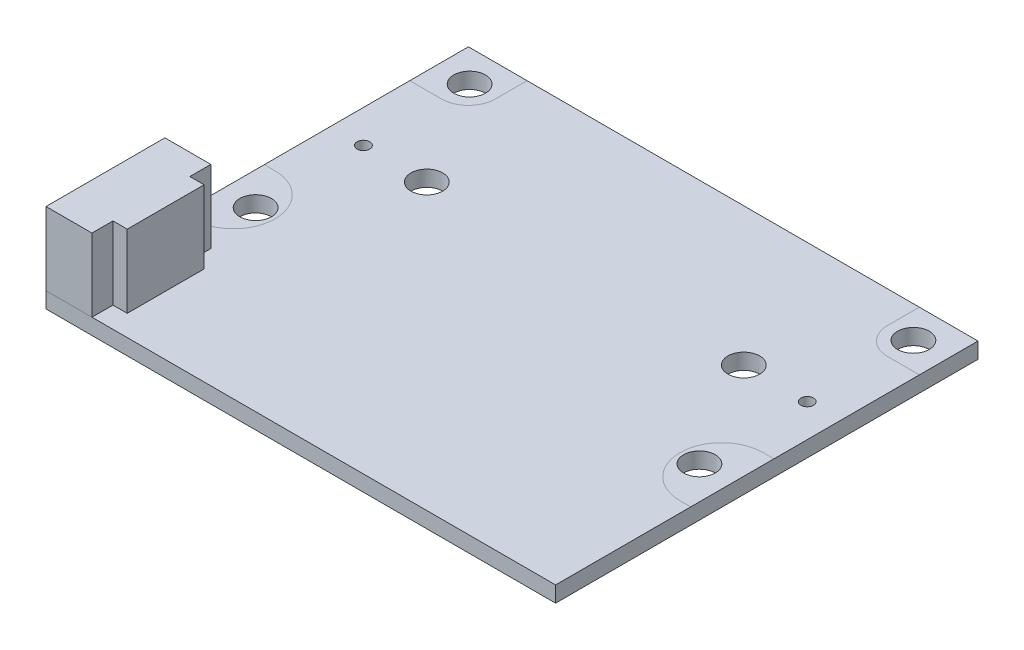
ISO-10303-21;
HEADER;
FILE_DESCRIPTION(('STEP AP214'),'2;1');
FILE_NAME('part.step','',(''),(''),'','','');
FILE_SCHEMA(('AUTOMOTIVE_DESIGN { 1 0 10303 214 1 1 1 1 }'));
ENDSEC;
DATA;
#1=APPLICATION_CONTEXT('core data for automotive mechanical design processes');
#2=APPLICATION_PROTOCOL_DEFINITION('international standard','automotive_design',2000,#1);
#3=PRODUCT_CONTEXT('',#1,'mechanical');
#4=PRODUCT('Part','Part','',(#3));
#5=PRODUCT_RELATED_PRODUCT_CATEGORY('part','',(#4));
#6=PRODUCT_DEFINITION_FORMATION('','',#4);
#7=PRODUCT_DEFINITION_CONTEXT('part definition',#1,'design');
#8=PRODUCT_DEFINITION('design','',#6,#7);
#9=PRODUCT_DEFINITION_SHAPE('','',#8);
#10=(LENGTH_UNIT() NAMED_UNIT(*) SI_UNIT(.MILLI.,.METRE.));
#11=(NAMED_UNIT(*) PLANE_ANGLE_UNIT() SI_UNIT($,.RADIAN.));
#12=(NAMED_UNIT(*) SI_UNIT($,.STERADIAN.) SOLID_ANGLE_UNIT());
#13=UNCERTAINTY_MEASURE_WITH_UNIT(LENGTH_MEASURE(1.E-05),#10,'distance_accuracy_value','');
#14=(GEOMETRIC_REPRESENTATION_CONTEXT(3) GLOBAL_UNCERTAINTY_ASSIGNED_CONTEXT((#13)) GLOBAL_UNIT_ASSIGNED_CONTEXT((#10,
#11,#12)) REPRESENTATION_CONTEXT('',''));
#15=CARTESIAN_POINT('',(0.,0.,0.));
#16=DIRECTION('',(0.,0.,1.));
#17=DIRECTION('',(1.,0.,0.));
#18=AXIS2_PLACEMENT_3D('',#15,#16,#17);
#19=CARTESIAN_POINT('',(-16.075,5.6,17.95));
#20=DIRECTION('',(1.,0.,0.));
#21=DIRECTION('',(0.,0.,-1.));
#22=AXIS2_PLACEMENT_3D('',#19,#20,#21);
#23=PLANE('',#22);
#24=DIRECTION('',(0.,0.,1.));
#25=VECTOR('',#24,1.);
#26=CARTESIAN_POINT('',(-16.075,1.,17.95));
#27=LINE('',#26,#25);
#28=CARTESIAN_POINT('',(-16.075,1.,10.45));
#29=VERTEX_POINT('',#28);
#30=CARTESIAN_POINT('',(-16.075,1.,17.95));
#31=VERTEX_POINT('',#30);
#32=EDGE_CURVE('E150',#29,#31,#27,.T.);
#33=ORIENTED_EDGE('',*,*,#32,.T.);
#34=DIRECTION('',(0.,-1.,0.));
#35=VECTOR('',#34,1.);
#36=CARTESIAN_POINT('',(-16.075,5.6,17.95));
#37=LINE('',#36,#35);
#38=CARTESIAN_POINT('',(-16.075,5.6,17.95));
#39=VERTEX_POINT('',#38);
#40=EDGE_CURVE('E12',#39,#31,#37,.T.);
#41=ORIENTED_EDGE('',*,*,#40,.F.);
#42=DIRECTION('',(0.,0.,1.));
#43=VECTOR('',#42,1.);
#44=CARTESIAN_POINT('',(-16.075,5.6,17.95));
#45=LINE('',#44,#43);
#46=CARTESIAN_POINT('',(-16.075,5.6,10.45));
#47=VERTEX_POINT('',#46);
#48=EDGE_CURVE('E164',#47,#39,#45,.T.);
#49=ORIENTED_EDGE('',*,*,#48,.F.);
#50=DIRECTION('',(0.,-1.,0.));
#51=VECTOR('',#50,1.);
#52=CARTESIAN_POINT('',(-16.075,5.6,10.45));
#53=LINE('',#52,#51);
#54=EDGE_CURVE('E146',#47,#29,#53,.T.);
#55=ORIENTED_EDGE('',*,*,#54,.T.);
#56=EDGE_LOOP('',(#33,#41,#49,#55));
#57=FACE_BOUND('',#56,.T.);
#58=ADVANCED_FACE('F54',(#57),#23,.F.);
#59=CARTESIAN_POINT('',(-16.075,5.6,17.95));
#60=DIRECTION('',(0.,0.,-1.));
#61=DIRECTION('',(-1.,0.,0.));
#62=AXIS2_PLACEMENT_3D('',#59,#60,#61);
#63=PLANE('',#62);
#64=DIRECTION('',(1.,0.,0.));
#65=VECTOR('',#64,1.);
#66=CARTESIAN_POINT('',(-16.075,1.,17.95));
#67=LINE('',#66,#65);
#68=CARTESIAN_POINT('',(-13.175,1.,17.95));
#69=VERTEX_POINT('',#68);
#70=EDGE_CURVE('E153',#31,#69,#67,.T.);
#71=ORIENTED_EDGE('',*,*,#70,.T.);
#72=DIRECTION('',(0.,-1.,0.));
#73=VECTOR('',#72,1.);
#74=CARTESIAN_POINT('',(-13.175,5.6,17.95));
#75=LINE('',#74,#73);
#76=CARTESIAN_POINT('',(-13.175,5.6,17.95));
#77=VERTEX_POINT('',#76);
#78=EDGE_CURVE('E62',#77,#69,#75,.T.);
#79=ORIENTED_EDGE('',*,*,#78,.F.);
#80=DIRECTION('',(1.,0.,0.));
#81=VECTOR('',#80,1.);
#82=CARTESIAN_POINT('',(-16.075,5.6,17.95));
#83=LINE('',#82,#81);
#84=EDGE_CURVE('E113',#39,#77,#83,.T.);
#85=ORIENTED_EDGE('',*,*,#84,.F.);
#86=ORIENTED_EDGE('',*,*,#40,.T.);
#87=EDGE_LOOP('',(#71,#79,#85,#86));
#88=FACE_BOUND('',#87,.T.);
#89=ADVANCED_FACE('F199',(#88),#63,.F.);
#90=CARTESIAN_POINT('',(-13.175,5.6,17.95));
#91=DIRECTION('',(-1.,0.,0.));
#92=DIRECTION('',(0.,0.,1.));
#93=AXIS2_PLACEMENT_3D('',#90,#91,#92);
#94=PLANE('',#93);
#95=DIRECTION('',(0.,0.,-1.));
#96=VECTOR('',#95,1.);
#97=CARTESIAN_POINT('',(-13.175,1.,17.95));
#98=LINE('',#97,#96);
#99=CARTESIAN_POINT('',(-13.175,1.,16.625));
#100=VERTEX_POINT('',#99);
#101=EDGE_CURVE('E155',#69,#100,#98,.T.);
#102=ORIENTED_EDGE('',*,*,#101,.T.);
#103=DIRECTION('',(0.,-1.,0.));
#104=VECTOR('',#103,1.);
#105=CARTESIAN_POINT('',(-13.175,5.6,16.625));
#106=LINE('',#105,#104);
#107=CARTESIAN_POINT('',(-13.175,5.6,16.625));
#108=VERTEX_POINT('',#107);
#109=EDGE_CURVE('E171',#108,#100,#106,.T.);
#110=ORIENTED_EDGE('',*,*,#109,.F.);
#111=DIRECTION('',(0.,0.,-1.));
#112=VECTOR('',#111,1.);
#113=CARTESIAN_POINT('',(-13.175,5.6,17.95));
#114=LINE('',#113,#112);
#115=EDGE_CURVE('E179',#77,#108,#114,.T.);
#116=ORIENTED_EDGE('',*,*,#115,.F.);
#117=ORIENTED_EDGE('',*,*,#78,.T.);
#118=EDGE_LOOP('',(#102,#110,#116,#117));
#119=FACE_BOUND('',#118,.T.);
#120=ADVANCED_FACE('F177',(#119),#94,.F.);
#121=CARTESIAN_POINT('',(-13.175,5.6,16.625));
#122=DIRECTION('',(0.,0.,-1.));
#123=DIRECTION('',(-1.,0.,0.));
#124=AXIS2_PLACEMENT_3D('',#121,#122,#123);
#125=PLANE('',#124);
#126=DIRECTION('',(1.,0.,0.));
#127=VECTOR('',#126,1.);
#128=CARTESIAN_POINT('',(-13.175,1.,16.625));
#129=LINE('',#128,#127);
#130=CARTESIAN_POINT('',(-12.275,1.,16.625));
#131=VERTEX_POINT('',#130);
#132=EDGE_CURVE('E157',#100,#131,#129,.T.);
#133=ORIENTED_EDGE('',*,*,#132,.T.);
#134=DIRECTION('',(0.,-1.,0.));
#135=VECTOR('',#134,1.);
#136=CARTESIAN_POINT('',(-12.275,5.6,16.625));
#137=LINE('',#136,#135);
#138=CARTESIAN_POINT('',(-12.275,5.6,16.625));
#139=VERTEX_POINT('',#138);
#140=EDGE_CURVE('E168',#139,#131,#137,.T.);
#141=ORIENTED_EDGE('',*,*,#140,.F.);
#142=DIRECTION('',(1.,0.,0.));
#143=VECTOR('',#142,1.);
#144=CARTESIAN_POINT('',(-13.175,5.6,16.625));
#145=LINE('',#144,#143);
#146=EDGE_CURVE('E191',#108,#139,#145,.T.);
#147=ORIENTED_EDGE('',*,*,#146,.F.);
#148=ORIENTED_EDGE('',*,*,#109,.T.);
#149=EDGE_LOOP('',(#133,#141,#147,#148));
#150=FACE_BOUND('',#149,.T.);
#151=ADVANCED_FACE('F187',(#150),#125,.F.);
#152=CARTESIAN_POINT('',(-12.275,5.6,16.625));
#153=DIRECTION('',(-1.,0.,0.));
#154=DIRECTION('',(0.,0.,1.));
#155=AXIS2_PLACEMENT_3D('',#152,#153,#154);
#156=PLANE('',#155);
#157=DIRECTION('',(0.,0.,-1.));
#158=VECTOR('',#157,1.);
#159=CARTESIAN_POINT('',(-12.275,1.,16.625));
#160=LINE('',#159,#158);
#161=CARTESIAN_POINT('',(-12.275,1.,11.775));
#162=VERTEX_POINT('',#161);
#163=EDGE_CURVE('E159',#131,#162,#160,.T.);
#164=ORIENTED_EDGE('',*,*,#163,.T.);
#165=DIRECTION('',(0.,-1.,0.));
#166=VECTOR('',#165,1.);
#167=CARTESIAN_POINT('',(-12.275,5.6,11.775));
#168=LINE('',#167,#166);
#169=CARTESIAN_POINT('',(-12.275,5.6,11.775));
#170=VERTEX_POINT('',#169);
#171=EDGE_CURVE('E141',#170,#162,#168,.T.);
#172=ORIENTED_EDGE('',*,*,#171,.F.);
#173=DIRECTION('',(0.,0.,-1.));
#174=VECTOR('',#173,1.);
#175=CARTESIAN_POINT('',(-12.275,5.6,16.625));
#176=LINE('',#175,#174);
#177=EDGE_CURVE('E132',#139,#170,#176,.T.);
#178=ORIENTED_EDGE('',*,*,#177,.F.);
#179=ORIENTED_EDGE('',*,*,#140,.T.);
#180=EDGE_LOOP('',(#164,#172,#178,#179));
#181=FACE_BOUND('',#180,.T.);
#182=ADVANCED_FACE('F190',(#181),#156,.F.);
#183=CARTESIAN_POINT('',(-13.175,5.6,11.775));
#184=DIRECTION('',(0.,0.,1.));
#185=DIRECTION('',(1.,0.,0.));
#186=AXIS2_PLACEMENT_3D('',#183,#184,#185);
#187=PLANE('',#186);
#188=DIRECTION('',(-1.,0.,0.));
#189=VECTOR('',#188,1.);
#190=CARTESIAN_POINT('',(-13.175,1.,11.775));
#191=LINE('',#190,#189);
#192=CARTESIAN_POINT('',(-13.175,1.,11.775));
#193=VERTEX_POINT('',#192);
#194=EDGE_CURVE('E140',#162,#193,#191,.T.);
#195=ORIENTED_EDGE('',*,*,#194,.T.);
#196=DIRECTION('',(0.,-1.,0.));
#197=VECTOR('',#196,1.);
#198=CARTESIAN_POINT('',(-13.175,5.6,11.775));
#199=LINE('',#198,#197);
#200=CARTESIAN_POINT('',(-13.175,5.6,11.775));
#201=VERTEX_POINT('',#200);
#202=EDGE_CURVE('E137',#201,#193,#199,.T.);
#203=ORIENTED_EDGE('',*,*,#202,.F.);
#204=DIRECTION('',(-1.,0.,0.));
#205=VECTOR('',#204,1.);
#206=CARTESIAN_POINT('',(-13.175,5.6,11.775));
#207=LINE('',#206,#205);
#208=EDGE_CURVE('E126',#170,#201,#207,.T.);
#209=ORIENTED_EDGE('',*,*,#208,.F.);
#210=ORIENTED_EDGE('',*,*,#171,.T.);
#211=EDGE_LOOP('',(#195,#203,#209,#210));
#212=FACE_BOUND('',#211,.T.);
#213=ADVANCED_FACE('F138',(#212),#187,.F.);
#214=CARTESIAN_POINT('',(-13.175,5.6,11.775));
#215=DIRECTION('',(-1.,0.,0.));
#216=DIRECTION('',(0.,0.,1.));
#217=AXIS2_PLACEMENT_3D('',#214,#215,#216);
#218=PLANE('',#217);
#219=DIRECTION('',(0.,0.,-1.));
#220=VECTOR('',#219,1.);
#221=CARTESIAN_POINT('',(-13.175,1.,11.775));
#222=LINE('',#221,#220);
#223=CARTESIAN_POINT('',(-13.175,1.,10.45));
#224=VERTEX_POINT('',#223);
#225=EDGE_CURVE('E99',#193,#224,#222,.T.);
#226=ORIENTED_EDGE('',*,*,#225,.T.);
#227=DIRECTION('',(0.,-1.,0.));
#228=VECTOR('',#227,1.);
#229=CARTESIAN_POINT('',(-13.175,5.6,10.45));
#230=LINE('',#229,#228);
#231=CARTESIAN_POINT('',(-13.175,5.6,10.45));
#232=VERTEX_POINT('',#231);
#233=EDGE_CURVE('E142',#232,#224,#230,.T.);
#234=ORIENTED_EDGE('',*,*,#233,.F.);
#235=DIRECTION('',(0.,0.,-1.));
#236=VECTOR('',#235,1.);
#237=CARTESIAN_POINT('',(-13.175,5.6,11.775));
#238=LINE('',#237,#236);
#239=EDGE_CURVE('E130',#201,#232,#238,.T.);
#240=ORIENTED_EDGE('',*,*,#239,.F.);
#241=ORIENTED_EDGE('',*,*,#202,.T.);
#242=EDGE_LOOP('',(#226,#234,#240,#241));
#243=FACE_BOUND('',#242,.T.);
#244=ADVANCED_FACE('F144',(#243),#218,.F.);
#245=CARTESIAN_POINT('',(-16.075,5.6,10.45));
#246=DIRECTION('',(0.,0.,1.));
#247=DIRECTION('',(1.,0.,0.));
#248=AXIS2_PLACEMENT_3D('',#245,#246,#247);
#249=PLANE('',#248);
#250=DIRECTION('',(-1.,0.,0.));
#251=VECTOR('',#250,1.);
#252=CARTESIAN_POINT('',(-16.075,1.,10.45));
#253=LINE('',#252,#251);
#254=EDGE_CURVE('E105',#224,#29,#253,.T.);
#255=ORIENTED_EDGE('',*,*,#254,.T.);
#256=ORIENTED_EDGE('',*,*,#54,.F.);
#257=DIRECTION('',(-1.,0.,0.));
#258=VECTOR('',#257,1.);
#259=CARTESIAN_POINT('',(-16.075,5.6,10.45));
#260=LINE('',#259,#258);
#261=EDGE_CURVE('E70',#232,#47,#260,.T.);
#262=ORIENTED_EDGE('',*,*,#261,.F.);
#263=ORIENTED_EDGE('',*,*,#233,.T.);
#264=EDGE_LOOP('',(#255,#256,#262,#263));
#265=FACE_BOUND('',#264,.T.);
#266=ADVANCED_FACE('F215',(#265),#249,.F.);
#267=CARTESIAN_POINT('',(0.,5.6,0.));
#268=DIRECTION('',(0.,-1.,0.));
#269=DIRECTION('',(0.,0.,-1.));
#270=AXIS2_PLACEMENT_3D('',#267,#268,#269);
#271=PLANE('',#270);
#272=ORIENTED_EDGE('',*,*,#48,.T.);
#273=ORIENTED_EDGE('',*,*,#84,.T.);
#274=ORIENTED_EDGE('',*,*,#115,.T.);
#275=ORIENTED_EDGE('',*,*,#146,.T.);
#276=ORIENTED_EDGE('',*,*,#177,.T.);
#277=ORIENTED_EDGE('',*,*,#208,.T.);
#278=ORIENTED_EDGE('',*,*,#239,.T.);
#279=ORIENTED_EDGE('',*,*,#261,.T.);
#280=EDGE_LOOP('',(#272,#273,#274,#275,#276,#277,#278,#279));
#281=FACE_BOUND('',#280,.T.);
#282=ADVANCED_FACE('F128',(#281),#271,.F.);
#283=CARTESIAN_POINT('',(0.,1.,0.));
#284=DIRECTION('',(0.,-1.,0.));
#285=DIRECTION('',(0.,0.,-1.));
#286=AXIS2_PLACEMENT_3D('',#283,#284,#285);
#287=PLANE('',#286);
#288=ORIENTED_EDGE('',*,*,#32,.F.);
#289=ORIENTED_EDGE('',*,*,#254,.F.);
#290=ORIENTED_EDGE('',*,*,#225,.F.);
#291=ORIENTED_EDGE('',*,*,#194,.F.);
#292=ORIENTED_EDGE('',*,*,#163,.F.);
#293=ORIENTED_EDGE('',*,*,#132,.F.);
#294=ORIENTED_EDGE('',*,*,#101,.F.);
#295=ORIENTED_EDGE('',*,*,#70,.F.);
#296=EDGE_LOOP('',(#288,#289,#290,#291,#292,#293,#294,#295));
#297=FACE_BOUND('',#296,.T.);
#298=ADVANCED_FACE('F183',(#297),#287,.T.);
#299=CLOSED_SHELL('',(#58,#89,#120,#151,#182,#213,#244,#266,#282,#298));
#300=MANIFOLD_SOLID_BREP('B2',#299);
#301=CARTESIAN_POINT('',(0.,0.,0.));
#302=DIRECTION('',(0.,-1.,0.));
#303=DIRECTION('',(0.,0.,-1.));
#304=AXIS2_PLACEMENT_3D('',#301,#302,#303);
#305=PLANE('',#304);
#306=CARTESIAN_POINT('',(-14.,0.,0.));
#307=DIRECTION('',(0.,1.,0.));
#308=DIRECTION('',(0.,0.,-1.));
#309=AXIS2_PLACEMENT_3D('',#306,#307,#308);
#310=CIRCLE('',#309,0.4);
#311=CARTESIAN_POINT('',(-14.,0.,-0.4));
#312=VERTEX_POINT('',#311);
#313=EDGE_CURVE('E601',#312,#312,#310,.T.);
#314=ORIENTED_EDGE('',*,*,#313,.T.);
#315=EDGE_LOOP('',(#314));
#316=FACE_BOUND('',#315,.T.);
#317=CARTESIAN_POINT('',(14.,0.,0.));
#318=DIRECTION('',(0.,1.,0.));
#319=DIRECTION('',(0.,0.,1.));
#320=AXIS2_PLACEMENT_3D('',#317,#318,#319);
#321=CIRCLE('',#320,0.4);
#322=CARTESIAN_POINT('',(14.,0.,0.4));
#323=VERTEX_POINT('',#322);
#324=EDGE_CURVE('E613',#323,#323,#321,.T.);
#325=ORIENTED_EDGE('',*,*,#324,.T.);
#326=EDGE_LOOP('',(#325));
#327=FACE_BOUND('',#326,.T.);
#328=CARTESIAN_POINT('',(10.,0.,0.));
#329=DIRECTION('',(0.,1.,0.));
#330=DIRECTION('',(0.,0.,1.));
#331=AXIS2_PLACEMENT_3D('',#328,#329,#330);
#332=CIRCLE('',#331,1.);
#333=CARTESIAN_POINT('',(10.,0.,1.));
#334=VERTEX_POINT('',#333);
#335=EDGE_CURVE('E607',#334,#334,#332,.T.);
#336=ORIENTED_EDGE('',*,*,#335,.T.);
#337=EDGE_LOOP('',(#336));
#338=FACE_BOUND('',#337,.T.);
#339=CARTESIAN_POINT('',(-10.,0.,0.));
#340=DIRECTION('',(0.,1.,0.));
#341=DIRECTION('',(0.,0.,-1.));
#342=AXIS2_PLACEMENT_3D('',#339,#340,#341);
#343=CIRCLE('',#342,1.);
#344=CARTESIAN_POINT('',(-10.,0.,-1.));
#345=VERTEX_POINT('',#344);
#346=EDGE_CURVE('E594',#345,#345,#343,.T.);
#347=ORIENTED_EDGE('',*,*,#346,.T.);
#348=EDGE_LOOP('',(#347));
#349=FACE_BOUND('',#348,.T.);
#350=CARTESIAN_POINT('',(-15.4,0.,6.8));
#351=DIRECTION('',(0.,-1.,0.));
#352=DIRECTION('',(0.,0.,-1.));
#353=AXIS2_PLACEMENT_3D('',#350,#351,#352);
#354=CIRCLE('',#353,2.625);
#355=CARTESIAN_POINT('',(-15.4,0.,9.425));
#356=VERTEX_POINT('',#355);
#357=CARTESIAN_POINT('',(-15.4,0.,4.175));
#358=VERTEX_POINT('',#357);
#359=EDGE_CURVE('E291',#356,#358,#354,.F.);
#360=ORIENTED_EDGE('',*,*,#359,.T.);
#361=DIRECTION('',(-1.,0.,0.));
#362=VECTOR('',#361,1.);
#363=CARTESIAN_POINT('',(0.,0.,4.175));
#364=LINE('',#363,#362);
#365=CARTESIAN_POINT('',(-16.075,0.,4.175));
#366=VERTEX_POINT('',#365);
#367=EDGE_CURVE('E52',#358,#366,#364,.T.);
#368=ORIENTED_EDGE('',*,*,#367,.T.);
#369=DIRECTION('',(0.,0.,1.));
#370=VECTOR('',#369,1.);
#371=CARTESIAN_POINT('',(-16.075,0.,17.95));
#372=LINE('',#371,#370);
#373=CARTESIAN_POINT('',(-16.075,0.,-5.));
#374=VERTEX_POINT('',#373);
#375=EDGE_CURVE('E529',#374,#366,#372,.T.);
#376=ORIENTED_EDGE('',*,*,#375,.F.);
#377=DIRECTION('',(1.,0.,0.));
#378=VECTOR('',#377,1.);
#379=CARTESIAN_POINT('',(0.,0.,-5.));
#380=LINE('',#379,#378);
#381=CARTESIAN_POINT('',(-14.075,0.,-5.));
#382=VERTEX_POINT('',#381);
#383=EDGE_CURVE('E461',#374,#382,#380,.T.);
#384=ORIENTED_EDGE('',*,*,#383,.T.);
#385=CARTESIAN_POINT('',(-14.075,0.,-6.7));
#386=DIRECTION('',(0.,-1.,0.));
#387=DIRECTION('',(0.,0.,-1.));
#388=AXIS2_PLACEMENT_3D('',#385,#386,#387);
#389=CIRCLE('',#388,1.7);
#390=CARTESIAN_POINT('',(-12.375,0.,-6.7));
#391=VERTEX_POINT('',#390);
#392=EDGE_CURVE('E465',#382,#391,#389,.F.);
#393=ORIENTED_EDGE('',*,*,#392,.T.);
#394=DIRECTION('',(0.,0.,-1.));
#395=VECTOR('',#394,1.);
#396=CARTESIAN_POINT('',(-12.375,0.,0.));
#397=LINE('',#396,#395);
#398=CARTESIAN_POINT('',(-12.375,0.,-8.7));
#399=VERTEX_POINT('',#398);
#400=EDGE_CURVE('E460',#391,#399,#397,.T.);
#401=ORIENTED_EDGE('',*,*,#400,.T.);
#402=DIRECTION('',(-1.,0.,0.));
#403=VECTOR('',#402,1.);
#404=CARTESIAN_POINT('',(-16.075,0.,-8.7));
#405=LINE('',#404,#403);
#406=CARTESIAN_POINT('',(12.375,0.,-8.7));
#407=VERTEX_POINT('',#406);
#408=EDGE_CURVE('E550',#407,#399,#405,.T.);
#409=ORIENTED_EDGE('',*,*,#408,.F.);
#410=DIRECTION('',(0.,0.,1.));
#411=VECTOR('',#410,1.);
#412=CARTESIAN_POINT('',(12.375,0.,0.));
#413=LINE('',#412,#411);
#414=CARTESIAN_POINT('',(12.375,0.,-6.7));
#415=VERTEX_POINT('',#414);
#416=EDGE_CURVE('E481',#407,#415,#413,.T.);
#417=ORIENTED_EDGE('',*,*,#416,.T.);
#418=CARTESIAN_POINT('',(14.075,0.,-6.7));
#419=DIRECTION('',(0.,-1.,0.));
#420=DIRECTION('',(0.,0.,-1.));
#421=AXIS2_PLACEMENT_3D('',#418,#419,#420);
#422=CIRCLE('',#421,1.7);
#423=CARTESIAN_POINT('',(14.075,0.,-5.));
#424=VERTEX_POINT('',#423);
#425=EDGE_CURVE('E485',#415,#424,#422,.F.);
#426=ORIENTED_EDGE('',*,*,#425,.T.);
#427=DIRECTION('',(1.,0.,0.));
#428=VECTOR('',#427,1.);
#429=CARTESIAN_POINT('',(0.,0.,-5.));
#430=LINE('',#429,#428);
#431=CARTESIAN_POINT('',(16.075,0.,-5.));
#432=VERTEX_POINT('',#431);
#433=EDGE_CURVE('E480',#424,#432,#430,.T.);
#434=ORIENTED_EDGE('',*,*,#433,.T.);
#435=DIRECTION('',(0.,0.,-1.));
#436=VECTOR('',#435,1.);
#437=CARTESIAN_POINT('',(16.075,0.,17.95));
#438=LINE('',#437,#436);
#439=CARTESIAN_POINT('',(16.075,0.,4.175));
#440=VERTEX_POINT('',#439);
#441=EDGE_CURVE('E547',#440,#432,#438,.T.);
#442=ORIENTED_EDGE('',*,*,#441,.F.);
#443=DIRECTION('',(-1.,0.,0.));
#444=VECTOR('',#443,1.);
#445=CARTESIAN_POINT('',(0.,0.,4.175));
#446=LINE('',#445,#444);
#447=CARTESIAN_POINT('',(15.4,0.,4.175));
#448=VERTEX_POINT('',#447);
#449=EDGE_CURVE('E504',#440,#448,#446,.T.);
#450=ORIENTED_EDGE('',*,*,#449,.T.);
#451=CARTESIAN_POINT('',(15.4,0.,6.8));
#452=DIRECTION('',(0.,-1.,0.));
#453=DIRECTION('',(0.,0.,-1.));
#454=AXIS2_PLACEMENT_3D('',#451,#452,#453);
#455=CIRCLE('',#454,2.625);
#456=CARTESIAN_POINT('',(15.4,0.,9.425));
#457=VERTEX_POINT('',#456);
#458=EDGE_CURVE('E500',#448,#457,#455,.F.);
#459=ORIENTED_EDGE('',*,*,#458,.T.);
#460=DIRECTION('',(1.,0.,0.));
#461=VECTOR('',#460,1.);
#462=CARTESIAN_POINT('',(0.,0.,9.425));
#463=LINE('',#462,#461);
#464=CARTESIAN_POINT('',(16.075,0.,9.425));
#465=VERTEX_POINT('',#464);
#466=EDGE_CURVE('E501',#457,#465,#463,.T.);
#467=ORIENTED_EDGE('',*,*,#466,.T.);
#468=CARTESIAN_POINT('',(16.075,0.,17.95));
#469=VERTEX_POINT('',#468);
#470=EDGE_CURVE('E542',#469,#465,#438,.T.);
#471=ORIENTED_EDGE('',*,*,#470,.F.);
#472=DIRECTION('',(1.,0.,0.));
#473=VECTOR('',#472,1.);
#474=CARTESIAN_POINT('',(-16.075,0.,17.95));
#475=LINE('',#474,#473);
#476=CARTESIAN_POINT('',(-16.075,0.,17.95));
#477=VERTEX_POINT('',#476);
#478=EDGE_CURVE('E535',#477,#469,#475,.T.);
#479=ORIENTED_EDGE('',*,*,#478,.F.);
#480=CARTESIAN_POINT('',(-16.075,0.,9.425));
#481=VERTEX_POINT('',#480);
#482=EDGE_CURVE('E443',#481,#477,#372,.T.);
#483=ORIENTED_EDGE('',*,*,#482,.F.);
#484=DIRECTION('',(1.,0.,0.));
#485=VECTOR('',#484,1.);
#486=CARTESIAN_POINT('',(0.,0.,9.425));
#487=LINE('',#486,#485);
#488=EDGE_CURVE('E285',#481,#356,#487,.T.);
#489=ORIENTED_EDGE('',*,*,#488,.T.);
#490=EDGE_LOOP('',(#360,#368,#376,#384,#393,#401,#409,#417,#426,#434,#442,#450,#459,#467,#471,
#479,#483,#489));
#491=FACE_BOUND('',#490,.T.);
#492=ADVANCED_FACE('F281',(#316,#327,#338,#349,#491),#305,.T.);
#493=CARTESIAN_POINT('',(0.,1.,0.));
#494=DIRECTION('',(0.,-1.,0.));
#495=DIRECTION('',(0.,0.,-1.));
#496=AXIS2_PLACEMENT_3D('',#493,#494,#495);
#497=PLANE('',#496);
#498=CARTESIAN_POINT('',(14.,1.,0.));
#499=DIRECTION('',(0.,1.,0.));
#500=DIRECTION('',(0.,0.,1.));
#501=AXIS2_PLACEMENT_3D('',#498,#499,#500);
#502=CIRCLE('',#501,0.4);
#503=CARTESIAN_POINT('',(14.,1.,0.4));
#504=VERTEX_POINT('',#503);
#505=EDGE_CURVE('E616',#504,#504,#502,.T.);
#506=ORIENTED_EDGE('',*,*,#505,.F.);
#507=EDGE_LOOP('',(#506));
#508=FACE_BOUND('',#507,.T.);
#509=CARTESIAN_POINT('',(10.,1.,0.));
#510=DIRECTION('',(0.,1.,0.));
#511=DIRECTION('',(0.,0.,1.));
#512=AXIS2_PLACEMENT_3D('',#509,#510,#511);
#513=CIRCLE('',#512,1.);
#514=CARTESIAN_POINT('',(10.,1.,1.));
#515=VERTEX_POINT('',#514);
#516=EDGE_CURVE('E610',#515,#515,#513,.T.);
#517=ORIENTED_EDGE('',*,*,#516,.F.);
#518=EDGE_LOOP('',(#517));
#519=FACE_BOUND('',#518,.T.);
#520=CARTESIAN_POINT('',(-14.,1.,0.));
#521=DIRECTION('',(0.,1.,0.));
#522=DIRECTION('',(0.,0.,-1.));
#523=AXIS2_PLACEMENT_3D('',#520,#521,#522);
#524=CIRCLE('',#523,0.4);
#525=CARTESIAN_POINT('',(-14.,1.,-0.4));
#526=VERTEX_POINT('',#525);
#527=EDGE_CURVE('E604',#526,#526,#524,.T.);
#528=ORIENTED_EDGE('',*,*,#527,.F.);
#529=EDGE_LOOP('',(#528));
#530=FACE_BOUND('',#529,.T.);
#531=CARTESIAN_POINT('',(-10.,1.,0.));
#532=DIRECTION('',(0.,1.,0.));
#533=DIRECTION('',(0.,0.,-1.));
#534=AXIS2_PLACEMENT_3D('',#531,#532,#533);
#535=CIRCLE('',#534,1.);
#536=CARTESIAN_POINT('',(-10.,1.,-1.));
#537=VERTEX_POINT('',#536);
#538=EDGE_CURVE('E588',#537,#537,#535,.T.);
#539=ORIENTED_EDGE('',*,*,#538,.F.);
#540=EDGE_LOOP('',(#539));
#541=FACE_BOUND('',#540,.T.);
#542=DIRECTION('',(-1.,0.,0.));
#543=VECTOR('',#542,1.);
#544=CARTESIAN_POINT('',(0.,1.,4.175));
#545=LINE('',#544,#543);
#546=CARTESIAN_POINT('',(-15.4,1.,4.175));
#547=VERTEX_POINT('',#546);
#548=CARTESIAN_POINT('',(-16.075,1.,4.175));
#549=VERTEX_POINT('',#548);
#550=EDGE_CURVE('E516',#547,#549,#545,.T.);
#551=ORIENTED_EDGE('',*,*,#550,.F.);
#552=CARTESIAN_POINT('',(-15.4,1.,6.8));
#553=DIRECTION('',(0.,-1.,0.));
#554=DIRECTION('',(0.,0.,-1.));
#555=AXIS2_PLACEMENT_3D('',#552,#553,#554);
#556=CIRCLE('',#555,2.625);
#557=CARTESIAN_POINT('',(-15.4,1.,9.425));
#558=VERTEX_POINT('',#557);
#559=EDGE_CURVE('E512',#558,#547,#556,.F.);
#560=ORIENTED_EDGE('',*,*,#559,.F.);
#561=DIRECTION('',(1.,0.,0.));
#562=VECTOR('',#561,1.);
#563=CARTESIAN_POINT('',(0.,1.,9.425));
#564=LINE('',#563,#562);
#565=CARTESIAN_POINT('',(-16.075,1.,9.425));
#566=VERTEX_POINT('',#565);
#567=EDGE_CURVE('E422',#566,#558,#564,.T.);
#568=ORIENTED_EDGE('',*,*,#567,.F.);
#569=DIRECTION('',(0.,0.,1.));
#570=VECTOR('',#569,1.);
#571=CARTESIAN_POINT('',(-16.075,1.,17.95));
#572=LINE('',#571,#570);
#573=CARTESIAN_POINT('',(-16.075,1.,17.95));
#574=VERTEX_POINT('',#573);
#575=EDGE_CURVE('E415',#566,#574,#572,.T.);
#576=ORIENTED_EDGE('',*,*,#575,.T.);
#577=DIRECTION('',(1.,0.,0.));
#578=VECTOR('',#577,1.);
#579=CARTESIAN_POINT('',(-16.075,1.,17.95));
#580=LINE('',#579,#578);
#581=CARTESIAN_POINT('',(16.075,1.,17.95));
#582=VERTEX_POINT('',#581);
#583=EDGE_CURVE('E419',#574,#582,#580,.T.);
#584=ORIENTED_EDGE('',*,*,#583,.T.);
#585=DIRECTION('',(0.,0.,-1.));
#586=VECTOR('',#585,1.);
#587=CARTESIAN_POINT('',(16.075,1.,17.95));
#588=LINE('',#587,#586);
#589=CARTESIAN_POINT('',(16.075,1.,9.425));
#590=VERTEX_POINT('',#589);
#591=EDGE_CURVE('E633',#582,#590,#588,.T.);
#592=ORIENTED_EDGE('',*,*,#591,.T.);
#593=DIRECTION('',(1.,0.,0.));
#594=VECTOR('',#593,1.);
#595=CARTESIAN_POINT('',(0.,1.,9.425));
#596=LINE('',#595,#594);
#597=CARTESIAN_POINT('',(15.4,1.,9.425));
#598=VERTEX_POINT('',#597);
#599=EDGE_CURVE('E497',#598,#590,#596,.T.);
#600=ORIENTED_EDGE('',*,*,#599,.F.);
#601=CARTESIAN_POINT('',(15.4,1.,6.8));
#602=DIRECTION('',(0.,-1.,0.));
#603=DIRECTION('',(0.,0.,-1.));
#604=AXIS2_PLACEMENT_3D('',#601,#602,#603);
#605=CIRCLE('',#604,2.625);
#606=CARTESIAN_POINT('',(15.4,1.,4.175));
#607=VERTEX_POINT('',#606);
#608=EDGE_CURVE('E484',#607,#598,#605,.F.);
#609=ORIENTED_EDGE('',*,*,#608,.F.);
#610=DIRECTION('',(-1.,0.,0.));
#611=VECTOR('',#610,1.);
#612=CARTESIAN_POINT('',(0.,1.,4.175));
#613=LINE('',#612,#611);
#614=CARTESIAN_POINT('',(16.075,1.,4.175));
#615=VERTEX_POINT('',#614);
#616=EDGE_CURVE('E494',#615,#607,#613,.T.);
#617=ORIENTED_EDGE('',*,*,#616,.F.);
#618=CARTESIAN_POINT('',(16.075,1.,-5.));
#619=VERTEX_POINT('',#618);
#620=EDGE_CURVE('E636',#615,#619,#588,.T.);
#621=ORIENTED_EDGE('',*,*,#620,.T.);
#622=DIRECTION('',(1.,0.,0.));
#623=VECTOR('',#622,1.);
#624=CARTESIAN_POINT('',(0.,1.,-5.));
#625=LINE('',#624,#623);
#626=CARTESIAN_POINT('',(14.075,1.,-5.));
#627=VERTEX_POINT('',#626);
#628=EDGE_CURVE('E464',#627,#619,#625,.T.);
#629=ORIENTED_EDGE('',*,*,#628,.F.);
#630=CARTESIAN_POINT('',(14.075,1.,-6.7));
#631=DIRECTION('',(0.,-1.,0.));
#632=DIRECTION('',(0.,0.,-1.));
#633=AXIS2_PLACEMENT_3D('',#630,#631,#632);
#634=CIRCLE('',#633,1.7);
#635=CARTESIAN_POINT('',(12.375,1.,-6.7));
#636=VERTEX_POINT('',#635);
#637=EDGE_CURVE('E474',#636,#627,#634,.F.);
#638=ORIENTED_EDGE('',*,*,#637,.F.);
#639=DIRECTION('',(0.,0.,1.));
#640=VECTOR('',#639,1.);
#641=CARTESIAN_POINT('',(12.375,1.,0.));
#642=LINE('',#641,#640);
#643=CARTESIAN_POINT('',(12.375,1.,-8.7));
#644=VERTEX_POINT('',#643);
#645=EDGE_CURVE('E477',#644,#636,#642,.T.);
#646=ORIENTED_EDGE('',*,*,#645,.F.);
#647=DIRECTION('',(-1.,0.,0.));
#648=VECTOR('',#647,1.);
#649=CARTESIAN_POINT('',(-16.075,1.,-8.7));
#650=LINE('',#649,#648);
#651=CARTESIAN_POINT('',(-12.375,1.,-8.7));
#652=VERTEX_POINT('',#651);
#653=EDGE_CURVE('E637',#644,#652,#650,.T.);
#654=ORIENTED_EDGE('',*,*,#653,.T.);
#655=DIRECTION('',(0.,0.,-1.));
#656=VECTOR('',#655,1.);
#657=CARTESIAN_POINT('',(-12.375,1.,0.));
#658=LINE('',#657,#656);
#659=CARTESIAN_POINT('',(-12.375,1.,-6.7));
#660=VERTEX_POINT('',#659);
#661=EDGE_CURVE('E445',#660,#652,#658,.T.);
#662=ORIENTED_EDGE('',*,*,#661,.F.);
#663=CARTESIAN_POINT('',(-14.075,1.,-6.7));
#664=DIRECTION('',(0.,-1.,0.));
#665=DIRECTION('',(0.,0.,-1.));
#666=AXIS2_PLACEMENT_3D('',#663,#664,#665);
#667=CIRCLE('',#666,1.7);
#668=CARTESIAN_POINT('',(-14.075,1.,-5.));
#669=VERTEX_POINT('',#668);
#670=EDGE_CURVE('E449',#669,#660,#667,.F.);
#671=ORIENTED_EDGE('',*,*,#670,.F.);
#672=DIRECTION('',(1.,0.,0.));
#673=VECTOR('',#672,1.);
#674=CARTESIAN_POINT('',(0.,1.,-5.));
#675=LINE('',#674,#673);
#676=CARTESIAN_POINT('',(-16.075,1.,-5.));
#677=VERTEX_POINT('',#676);
#678=EDGE_CURVE('E457',#677,#669,#675,.T.);
#679=ORIENTED_EDGE('',*,*,#678,.F.);
#680=EDGE_CURVE('E632',#677,#549,#572,.T.);
#681=ORIENTED_EDGE('',*,*,#680,.T.);
#682=EDGE_LOOP('',(#551,#560,#568,#576,#584,#592,#600,#609,#617,#621,#629,#638,#646,#654,#662,
#671,#679,#681));
#683=FACE_BOUND('',#682,.T.);
#684=ADVANCED_FACE('F417',(#508,#519,#530,#541,#683),#497,.F.);
#685=ORIENTED_EDGE('',*,*,#367,.F.);
#686=ORIENTED_EDGE('',*,*,#359,.F.);
#687=ORIENTED_EDGE('',*,*,#488,.F.);
#688=EDGE_CURVE('E527',#366,#481,#372,.T.);
#689=ORIENTED_EDGE('',*,*,#688,.F.);
#690=EDGE_LOOP('',(#685,#686,#687,#689));
#691=FACE_BOUND('',#690,.T.);
#692=CARTESIAN_POINT('',(-14.,0.,6.8));
#693=DIRECTION('',(0.,1.,0.));
#694=DIRECTION('',(0.,0.,-1.));
#695=AXIS2_PLACEMENT_3D('',#692,#693,#694);
#696=CIRCLE('',#695,1.);
#697=CARTESIAN_POINT('',(-14.,0.,5.8));
#698=VERTEX_POINT('',#697);
#699=EDGE_CURVE('E591',#698,#698,#696,.T.);
#700=ORIENTED_EDGE('',*,*,#699,.T.);
#701=EDGE_LOOP('',(#700));
#702=FACE_BOUND('',#701,.T.);
#703=ADVANCED_FACE('F525',(#691,#702),#305,.T.);
#704=CARTESIAN_POINT('',(-14.,1.,6.8));
#705=DIRECTION('',(0.,1.,0.));
#706=DIRECTION('',(0.,0.,-1.));
#707=AXIS2_PLACEMENT_3D('',#704,#705,#706);
#708=CIRCLE('',#707,1.);
#709=CARTESIAN_POINT('',(-14.,1.,5.8));
#710=VERTEX_POINT('',#709);
#711=EDGE_CURVE('E598',#710,#710,#708,.T.);
#712=ORIENTED_EDGE('',*,*,#711,.F.);
#713=EDGE_LOOP('',(#712));
#714=FACE_BOUND('',#713,.T.);
#715=ORIENTED_EDGE('',*,*,#559,.T.);
#716=ORIENTED_EDGE('',*,*,#550,.T.);
#717=EDGE_CURVE('E427',#549,#566,#572,.T.);
#718=ORIENTED_EDGE('',*,*,#717,.T.);
#719=ORIENTED_EDGE('',*,*,#567,.T.);
#720=EDGE_LOOP('',(#715,#716,#718,#719));
#721=FACE_BOUND('',#720,.T.);
#722=ADVANCED_FACE('F652',(#714,#721),#497,.F.);
#723=ORIENTED_EDGE('',*,*,#466,.F.);
#724=ORIENTED_EDGE('',*,*,#458,.F.);
#725=ORIENTED_EDGE('',*,*,#449,.F.);
#726=EDGE_CURVE('E546',#465,#440,#438,.T.);
#727=ORIENTED_EDGE('',*,*,#726,.F.);
#728=EDGE_LOOP('',(#723,#724,#725,#727));
#729=FACE_BOUND('',#728,.T.);
#730=CARTESIAN_POINT('',(14.,0.,6.8));
#731=DIRECTION('',(0.,1.,0.));
#732=DIRECTION('',(0.,0.,1.));
#733=AXIS2_PLACEMENT_3D('',#730,#731,#732);
#734=CIRCLE('',#733,1.);
#735=CARTESIAN_POINT('',(14.,0.,7.8));
#736=VERTEX_POINT('',#735);
#737=EDGE_CURVE('E619',#736,#736,#734,.T.);
#738=ORIENTED_EDGE('',*,*,#737,.T.);
#739=EDGE_LOOP('',(#738));
#740=FACE_BOUND('',#739,.T.);
#741=ADVANCED_FACE('F649',(#729,#740),#305,.T.);
#742=CARTESIAN_POINT('',(14.,1.,6.8));
#743=DIRECTION('',(0.,1.,0.));
#744=DIRECTION('',(0.,0.,1.));
#745=AXIS2_PLACEMENT_3D('',#742,#743,#744);
#746=CIRCLE('',#745,1.);
#747=CARTESIAN_POINT('',(14.,1.,7.8));
#748=VERTEX_POINT('',#747);
#749=EDGE_CURVE('E622',#748,#748,#746,.T.);
#750=ORIENTED_EDGE('',*,*,#749,.F.);
#751=EDGE_LOOP('',(#750));
#752=FACE_BOUND('',#751,.T.);
#753=ORIENTED_EDGE('',*,*,#608,.T.);
#754=ORIENTED_EDGE('',*,*,#599,.T.);
#755=EDGE_CURVE('E635',#590,#615,#588,.T.);
#756=ORIENTED_EDGE('',*,*,#755,.T.);
#757=ORIENTED_EDGE('',*,*,#616,.T.);
#758=EDGE_LOOP('',(#753,#754,#756,#757));
#759=FACE_BOUND('',#758,.T.);
#760=ADVANCED_FACE('F646',(#752,#759),#497,.F.);
#761=ORIENTED_EDGE('',*,*,#416,.F.);
#762=CARTESIAN_POINT('',(16.075,0.,-8.7));
#763=VERTEX_POINT('',#762);
#764=EDGE_CURVE('E428',#763,#407,#405,.T.);
#765=ORIENTED_EDGE('',*,*,#764,.F.);
#766=EDGE_CURVE('E541',#432,#763,#438,.T.);
#767=ORIENTED_EDGE('',*,*,#766,.F.);
#768=ORIENTED_EDGE('',*,*,#433,.F.);
#769=ORIENTED_EDGE('',*,*,#425,.F.);
#770=EDGE_LOOP('',(#761,#765,#767,#768,#769));
#771=FACE_BOUND('',#770,.T.);
#772=CARTESIAN_POINT('',(14.,0.,-6.7));
#773=DIRECTION('',(0.,1.,0.));
#774=DIRECTION('',(0.,0.,1.));
#775=AXIS2_PLACEMENT_3D('',#772,#773,#774);
#776=CIRCLE('',#775,1.);
#777=CARTESIAN_POINT('',(14.,0.,-5.7));
#778=VERTEX_POINT('',#777);
#779=EDGE_CURVE('E625',#778,#778,#776,.T.);
#780=ORIENTED_EDGE('',*,*,#779,.T.);
#781=EDGE_LOOP('',(#780));
#782=FACE_BOUND('',#781,.T.);
#783=ADVANCED_FACE('F564',(#771,#782),#305,.T.);
#784=CARTESIAN_POINT('',(14.,1.,-6.7));
#785=DIRECTION('',(0.,1.,0.));
#786=DIRECTION('',(0.,0.,1.));
#787=AXIS2_PLACEMENT_3D('',#784,#785,#786);
#788=CIRCLE('',#787,1.);
#789=CARTESIAN_POINT('',(14.,1.,-5.7));
#790=VERTEX_POINT('',#789);
#791=EDGE_CURVE('E628',#790,#790,#788,.T.);
#792=ORIENTED_EDGE('',*,*,#791,.F.);
#793=EDGE_LOOP('',(#792));
#794=FACE_BOUND('',#793,.T.);
#795=CARTESIAN_POINT('',(16.075,1.,-8.7));
#796=VERTEX_POINT('',#795);
#797=EDGE_CURVE('E538',#796,#644,#650,.T.);
#798=ORIENTED_EDGE('',*,*,#797,.T.);
#799=ORIENTED_EDGE('',*,*,#645,.T.);
#800=ORIENTED_EDGE('',*,*,#637,.T.);
#801=ORIENTED_EDGE('',*,*,#628,.T.);
#802=EDGE_CURVE('E438',#619,#796,#588,.T.);
#803=ORIENTED_EDGE('',*,*,#802,.T.);
#804=EDGE_LOOP('',(#798,#799,#800,#801,#803));
#805=FACE_BOUND('',#804,.T.);
#806=ADVANCED_FACE('F640',(#794,#805),#497,.F.);
#807=CARTESIAN_POINT('',(-16.075,1.,-8.7));
#808=VERTEX_POINT('',#807);
#809=EDGE_CURVE('E430',#808,#677,#572,.T.);
#810=ORIENTED_EDGE('',*,*,#809,.T.);
#811=ORIENTED_EDGE('',*,*,#678,.T.);
#812=ORIENTED_EDGE('',*,*,#670,.T.);
#813=ORIENTED_EDGE('',*,*,#661,.T.);
#814=EDGE_CURVE('E634',#652,#808,#650,.T.);
#815=ORIENTED_EDGE('',*,*,#814,.T.);
#816=EDGE_LOOP('',(#810,#811,#812,#813,#815));
#817=FACE_BOUND('',#816,.T.);
#818=CARTESIAN_POINT('',(-14.,1.,-6.7));
#819=DIRECTION('',(0.,1.,0.));
#820=DIRECTION('',(0.,0.,-1.));
#821=AXIS2_PLACEMENT_3D('',#818,#819,#820);
#822=CIRCLE('',#821,1.);
#823=CARTESIAN_POINT('',(-14.,1.,-7.7));
#824=VERTEX_POINT('',#823);
#825=EDGE_CURVE('E587',#824,#824,#822,.T.);
#826=ORIENTED_EDGE('',*,*,#825,.F.);
#827=EDGE_LOOP('',(#826));
#828=FACE_BOUND('',#827,.T.);
#829=ADVANCED_FACE('F581',(#817,#828),#497,.F.);
#830=ORIENTED_EDGE('',*,*,#383,.F.);
#831=CARTESIAN_POINT('',(-16.075,0.,-8.7));
#832=VERTEX_POINT('',#831);
#833=EDGE_CURVE('E534',#832,#374,#372,.T.);
#834=ORIENTED_EDGE('',*,*,#833,.F.);
#835=EDGE_CURVE('E545',#399,#832,#405,.T.);
#836=ORIENTED_EDGE('',*,*,#835,.F.);
#837=ORIENTED_EDGE('',*,*,#400,.F.);
#838=ORIENTED_EDGE('',*,*,#392,.F.);
#839=EDGE_LOOP('',(#830,#834,#836,#837,#838));
#840=FACE_BOUND('',#839,.T.);
#841=CARTESIAN_POINT('',(-14.,0.,-6.7));
#842=DIRECTION('',(0.,1.,0.));
#843=DIRECTION('',(0.,0.,-1.));
#844=AXIS2_PLACEMENT_3D('',#841,#842,#843);
#845=CIRCLE('',#844,1.);
#846=CARTESIAN_POINT('',(-14.,0.,-7.7));
#847=VERTEX_POINT('',#846);
#848=EDGE_CURVE('E585',#847,#847,#845,.T.);
#849=ORIENTED_EDGE('',*,*,#848,.T.);
#850=EDGE_LOOP('',(#849));
#851=FACE_BOUND('',#850,.T.);
#852=ADVANCED_FACE('F577',(#840,#851),#305,.T.);
#853=CARTESIAN_POINT('',(-16.075,1.,17.95));
#854=DIRECTION('',(1.,0.,0.));
#855=DIRECTION('',(0.,0.,-1.));
#856=AXIS2_PLACEMENT_3D('',#853,#854,#855);
#857=PLANE('',#856);
#858=ORIENTED_EDGE('',*,*,#833,.T.);
#859=ORIENTED_EDGE('',*,*,#375,.T.);
#860=ORIENTED_EDGE('',*,*,#688,.T.);
#861=ORIENTED_EDGE('',*,*,#482,.T.);
#862=DIRECTION('',(0.,-1.,0.));
#863=VECTOR('',#862,1.);
#864=CARTESIAN_POINT('',(-16.075,1.,17.95));
#865=LINE('',#864,#863);
#866=EDGE_CURVE('E434',#574,#477,#865,.T.);
#867=ORIENTED_EDGE('',*,*,#866,.F.);
#868=ORIENTED_EDGE('',*,*,#575,.F.);
#869=ORIENTED_EDGE('',*,*,#717,.F.);
#870=ORIENTED_EDGE('',*,*,#680,.F.);
#871=ORIENTED_EDGE('',*,*,#809,.F.);
#872=DIRECTION('',(0.,-1.,0.));
#873=VECTOR('',#872,1.);
#874=CARTESIAN_POINT('',(-16.075,1.,-8.7));
#875=LINE('',#874,#873);
#876=EDGE_CURVE('E551',#808,#832,#875,.T.);
#877=ORIENTED_EDGE('',*,*,#876,.T.);
#878=EDGE_LOOP('',(#858,#859,#860,#861,#867,#868,#869,#870,#871,#877));
#879=FACE_BOUND('',#878,.T.);
#880=ADVANCED_FACE('F283',(#879),#857,.F.);
#881=CARTESIAN_POINT('',(-16.075,1.,17.95));
#882=DIRECTION('',(0.,0.,-1.));
#883=DIRECTION('',(-1.,0.,0.));
#884=AXIS2_PLACEMENT_3D('',#881,#882,#883);
#885=PLANE('',#884);
#886=ORIENTED_EDGE('',*,*,#478,.T.);
#887=DIRECTION('',(0.,-1.,0.));
#888=VECTOR('',#887,1.);
#889=CARTESIAN_POINT('',(16.075,1.,17.95));
#890=LINE('',#889,#888);
#891=EDGE_CURVE('E436',#582,#469,#890,.T.);
#892=ORIENTED_EDGE('',*,*,#891,.F.);
#893=ORIENTED_EDGE('',*,*,#583,.F.);
#894=ORIENTED_EDGE('',*,*,#866,.T.);
#895=EDGE_LOOP('',(#886,#892,#893,#894));
#896=FACE_BOUND('',#895,.T.);
#897=ADVANCED_FACE('F433',(#896),#885,.F.);
#898=CARTESIAN_POINT('',(16.075,1.,17.95));
#899=DIRECTION('',(-1.,0.,0.));
#900=DIRECTION('',(0.,0.,1.));
#901=AXIS2_PLACEMENT_3D('',#898,#899,#900);
#902=PLANE('',#901);
#903=ORIENTED_EDGE('',*,*,#470,.T.);
#904=ORIENTED_EDGE('',*,*,#726,.T.);
#905=ORIENTED_EDGE('',*,*,#441,.T.);
#906=ORIENTED_EDGE('',*,*,#766,.T.);
#907=DIRECTION('',(0.,-1.,0.));
#908=VECTOR('',#907,1.);
#909=CARTESIAN_POINT('',(16.075,1.,-8.7));
#910=LINE('',#909,#908);
#911=EDGE_CURVE('E451',#796,#763,#910,.T.);
#912=ORIENTED_EDGE('',*,*,#911,.F.);
#913=ORIENTED_EDGE('',*,*,#802,.F.);
#914=ORIENTED_EDGE('',*,*,#620,.F.);
#915=ORIENTED_EDGE('',*,*,#755,.F.);
#916=ORIENTED_EDGE('',*,*,#591,.F.);
#917=ORIENTED_EDGE('',*,*,#891,.T.);
#918=EDGE_LOOP('',(#903,#904,#905,#906,#912,#913,#914,#915,#916,#917));
#919=FACE_BOUND('',#918,.T.);
#920=ADVANCED_FACE('F643',(#919),#902,.F.);
#921=CARTESIAN_POINT('',(-16.075,1.,-8.7));
#922=DIRECTION('',(0.,0.,1.));
#923=DIRECTION('',(1.,0.,0.));
#924=AXIS2_PLACEMENT_3D('',#921,#922,#923);
#925=PLANE('',#924);
#926=ORIENTED_EDGE('',*,*,#764,.T.);
#927=ORIENTED_EDGE('',*,*,#408,.T.);
#928=ORIENTED_EDGE('',*,*,#835,.T.);
#929=ORIENTED_EDGE('',*,*,#876,.F.);
#930=ORIENTED_EDGE('',*,*,#814,.F.);
#931=ORIENTED_EDGE('',*,*,#653,.F.);
#932=ORIENTED_EDGE('',*,*,#797,.F.);
#933=ORIENTED_EDGE('',*,*,#911,.T.);
#934=EDGE_LOOP('',(#926,#927,#928,#929,#930,#931,#932,#933));
#935=FACE_BOUND('',#934,.T.);
#936=ADVANCED_FACE('F557',(#935),#925,.F.);
#937=CARTESIAN_POINT('',(14.,1.,-6.7));
#938=DIRECTION('',(0.,-1.,0.));
#939=DIRECTION('',(0.,0.,-1.));
#940=AXIS2_PLACEMENT_3D('',#937,#938,#939);
#941=CYLINDRICAL_SURFACE('',#940,1.);
#942=ORIENTED_EDGE('',*,*,#791,.T.);
#943=EDGE_LOOP('',(#942));
#944=FACE_BOUND('',#943,.T.);
#945=ORIENTED_EDGE('',*,*,#779,.F.);
#946=EDGE_LOOP('',(#945));
#947=FACE_BOUND('',#946,.T.);
#948=ADVANCED_FACE('F730',(#944,#947),#941,.F.);
#949=CARTESIAN_POINT('',(14.,1.,6.8));
#950=DIRECTION('',(0.,-1.,0.));
#951=DIRECTION('',(0.,0.,-1.));
#952=AXIS2_PLACEMENT_3D('',#949,#950,#951);
#953=CYLINDRICAL_SURFACE('',#952,1.);
#954=ORIENTED_EDGE('',*,*,#749,.T.);
#955=EDGE_LOOP('',(#954));
#956=FACE_BOUND('',#955,.T.);
#957=ORIENTED_EDGE('',*,*,#737,.F.);
#958=EDGE_LOOP('',(#957));
#959=FACE_BOUND('',#958,.T.);
#960=ADVANCED_FACE('F735',(#956,#959),#953,.F.);
#961=CARTESIAN_POINT('',(14.,1.,0.));
#962=DIRECTION('',(0.,-1.,0.));
#963=DIRECTION('',(0.,0.,-1.));
#964=AXIS2_PLACEMENT_3D('',#961,#962,#963);
#965=CYLINDRICAL_SURFACE('',#964,0.4);
#966=ORIENTED_EDGE('',*,*,#505,.T.);
#967=EDGE_LOOP('',(#966));
#968=FACE_BOUND('',#967,.T.);
#969=ORIENTED_EDGE('',*,*,#324,.F.);
#970=EDGE_LOOP('',(#969));
#971=FACE_BOUND('',#970,.T.);
#972=ADVANCED_FACE('F742',(#968,#971),#965,.F.);
#973=CARTESIAN_POINT('',(10.,1.,0.));
#974=DIRECTION('',(0.,-1.,0.));
#975=DIRECTION('',(0.,0.,-1.));
#976=AXIS2_PLACEMENT_3D('',#973,#974,#975);
#977=CYLINDRICAL_SURFACE('',#976,1.);
#978=ORIENTED_EDGE('',*,*,#516,.T.);
#979=EDGE_LOOP('',(#978));
#980=FACE_BOUND('',#979,.T.);
#981=ORIENTED_EDGE('',*,*,#335,.F.);
#982=EDGE_LOOP('',(#981));
#983=FACE_BOUND('',#982,.T.);
#984=ADVANCED_FACE('F750',(#980,#983),#977,.F.);
#985=CARTESIAN_POINT('',(-14.,1.,0.));
#986=DIRECTION('',(0.,-1.,0.));
#987=DIRECTION('',(0.,0.,-1.));
#988=AXIS2_PLACEMENT_3D('',#985,#986,#987);
#989=CYLINDRICAL_SURFACE('',#988,0.4);
#990=ORIENTED_EDGE('',*,*,#527,.T.);
#991=EDGE_LOOP('',(#990));
#992=FACE_BOUND('',#991,.T.);
#993=ORIENTED_EDGE('',*,*,#313,.F.);
#994=EDGE_LOOP('',(#993));
#995=FACE_BOUND('',#994,.T.);
#996=ADVANCED_FACE('F758',(#992,#995),#989,.F.);
#997=CARTESIAN_POINT('',(-14.,1.,6.8));
#998=DIRECTION('',(0.,-1.,0.));
#999=DIRECTION('',(0.,0.,-1.));
#1000=AXIS2_PLACEMENT_3D('',#997,#998,#999);
#1001=CYLINDRICAL_SURFACE('',#1000,1.);
#1002=ORIENTED_EDGE('',*,*,#711,.T.);
#1003=EDGE_LOOP('',(#1002));
#1004=FACE_BOUND('',#1003,.T.);
#1005=ORIENTED_EDGE('',*,*,#699,.F.);
#1006=EDGE_LOOP('',(#1005));
#1007=FACE_BOUND('',#1006,.T.);
#1008=ADVANCED_FACE('F766',(#1004,#1007),#1001,.F.);
#1009=CARTESIAN_POINT('',(-14.,1.,-6.7));
#1010=DIRECTION('',(0.,-1.,0.));
#1011=DIRECTION('',(0.,0.,-1.));
#1012=AXIS2_PLACEMENT_3D('',#1009,#1010,#1011);
#1013=CYLINDRICAL_SURFACE('',#1012,1.);
#1014=ORIENTED_EDGE('',*,*,#825,.T.);
#1015=EDGE_LOOP('',(#1014));
#1016=FACE_BOUND('',#1015,.T.);
#1017=ORIENTED_EDGE('',*,*,#848,.F.);
#1018=EDGE_LOOP('',(#1017));
#1019=FACE_BOUND('',#1018,.T.);
#1020=ADVANCED_FACE('F774',(#1016,#1019),#1013,.F.);
#1021=CARTESIAN_POINT('',(-10.,1.,0.));
#1022=DIRECTION('',(0.,-1.,0.));
#1023=DIRECTION('',(0.,0.,-1.));
#1024=AXIS2_PLACEMENT_3D('',#1021,#1022,#1023);
#1025=CYLINDRICAL_SURFACE('',#1024,1.);
#1026=ORIENTED_EDGE('',*,*,#538,.T.);
#1027=EDGE_LOOP('',(#1026));
#1028=FACE_BOUND('',#1027,.T.);
#1029=ORIENTED_EDGE('',*,*,#346,.F.);
#1030=EDGE_LOOP('',(#1029));
#1031=FACE_BOUND('',#1030,.T.);
#1032=ADVANCED_FACE('F782',(#1028,#1031),#1025,.F.);
#1033=CLOSED_SHELL('',(#492,#684,#703,#722,#741,#760,#783,#806,#829,#852,#880,#897,#920,#936,
#948,#960,#972,#984,#996,#1008,#1020,#1032));
#1034=MANIFOLD_SOLID_BREP('B6',#1033);
#1035=ADVANCED_BREP_SHAPE_REPRESENTATION('',(#18,#300,#1034),#14);
#1036=SHAPE_DEFINITION_REPRESENTATION(#9,#1035);
ENDSEC;
END-ISO-10303-21;
